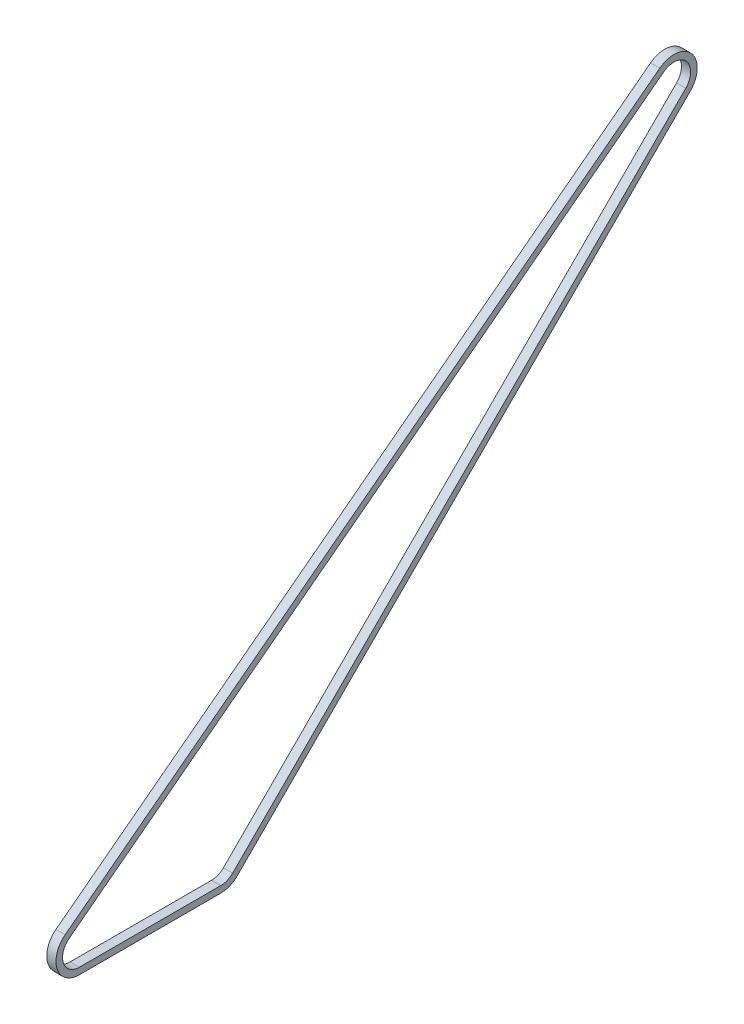
ISO-10303-21;
HEADER;
FILE_DESCRIPTION(('STEP AP214'),'2;1');
FILE_NAME('part.step','',(''),(''),'','','');
FILE_SCHEMA(('AUTOMOTIVE_DESIGN { 1 0 10303 214 1 1 1 1 }'));
ENDSEC;
DATA;
#1=APPLICATION_CONTEXT('core data for automotive mechanical design processes');
#2=APPLICATION_PROTOCOL_DEFINITION('international standard','automotive_design',2000,#1);
#3=PRODUCT_CONTEXT('',#1,'mechanical');
#4=PRODUCT('Part','Part','',(#3));
#5=PRODUCT_RELATED_PRODUCT_CATEGORY('part','',(#4));
#6=PRODUCT_DEFINITION_FORMATION('','',#4);
#7=PRODUCT_DEFINITION_CONTEXT('part definition',#1,'design');
#8=PRODUCT_DEFINITION('design','',#6,#7);
#9=PRODUCT_DEFINITION_SHAPE('','',#8);
#10=(LENGTH_UNIT() NAMED_UNIT(*) SI_UNIT(.MILLI.,.METRE.));
#11=(NAMED_UNIT(*) PLANE_ANGLE_UNIT() SI_UNIT($,.RADIAN.));
#12=(NAMED_UNIT(*) SI_UNIT($,.STERADIAN.) SOLID_ANGLE_UNIT());
#13=UNCERTAINTY_MEASURE_WITH_UNIT(LENGTH_MEASURE(1.E-05),#10,'distance_accuracy_value','');
#14=(GEOMETRIC_REPRESENTATION_CONTEXT(3) GLOBAL_UNCERTAINTY_ASSIGNED_CONTEXT((#13)) GLOBAL_UNIT_ASSIGNED_CONTEXT((#10,
#11,#12)) REPRESENTATION_CONTEXT('',''));
#15=CARTESIAN_POINT('',(0.,0.,0.));
#16=DIRECTION('',(0.,0.,1.));
#17=DIRECTION('',(1.,0.,0.));
#18=AXIS2_PLACEMENT_3D('',#15,#16,#17);
#19=CARTESIAN_POINT('',(8.407,16.9296795307969,12.9010532897323));
#20=DIRECTION('',(0.,0.795380762546252,0.606110091131423));
#21=DIRECTION('',(0.,-0.606110091131424,0.795380762546252));
#22=AXIS2_PLACEMENT_3D('',#19,#20,#21);
#23=PLANE('',#22);
#24=DIRECTION('',(0.,0.606110091131423,-0.795380762546252));
#25=VECTOR('',#24,1.);
#26=CARTESIAN_POINT('',(0.,16.9296795307969,12.9010532897323));
#27=LINE('',#26,#25);
#28=CARTESIAN_POINT('',(0.,16.9296795307969,12.9010532897323));
#29=VERTEX_POINT('',#28);
#30=CARTESIAN_POINT('',(0.,430.672723758447,-530.041990937922));
#31=VERTEX_POINT('',#30);
#32=EDGE_CURVE('E196',#29,#31,#27,.T.);
#33=ORIENTED_EDGE('',*,*,#32,.F.);
#34=DIRECTION('',(-1.,0.,0.));
#35=VECTOR('',#34,1.);
#36=CARTESIAN_POINT('',(8.407,16.9296795307969,12.9010532897323));
#37=LINE('',#36,#35);
#38=CARTESIAN_POINT('',(8.407,16.9296795307969,12.9010532897323));
#39=VERTEX_POINT('',#38);
#40=EDGE_CURVE('E11',#39,#29,#37,.T.);
#41=ORIENTED_EDGE('',*,*,#40,.F.);
#42=DIRECTION('',(0.,0.606110091131423,-0.795380762546252));
#43=VECTOR('',#42,1.);
#44=CARTESIAN_POINT('',(8.407,16.9296795307969,12.9010532897323));
#45=LINE('',#44,#43);
#46=CARTESIAN_POINT('',(8.407,430.672723758447,-530.041990937922));
#47=VERTEX_POINT('',#46);
#48=EDGE_CURVE('E219',#39,#47,#45,.T.);
#49=ORIENTED_EDGE('',*,*,#48,.T.);
#50=DIRECTION('',(-1.,0.,0.));
#51=VECTOR('',#50,1.);
#52=CARTESIAN_POINT('',(8.407,430.672723758447,-530.041990937922));
#53=LINE('',#52,#51);
#54=EDGE_CURVE('E106',#47,#31,#53,.T.);
#55=ORIENTED_EDGE('',*,*,#54,.T.);
#56=EDGE_LOOP('',(#33,#41,#49,#55));
#57=FACE_BOUND('',#56,.T.);
#58=ADVANCED_FACE('F41',(#57),#23,.T.);
#59=CARTESIAN_POINT('',(8.407,0.,0.));
#60=DIRECTION('',(-1.,0.,0.));
#61=DIRECTION('',(0.,0.,1.));
#62=AXIS2_PLACEMENT_3D('',#59,#60,#61);
#63=CYLINDRICAL_SURFACE('',#62,21.285);
#64=CARTESIAN_POINT('',(0.,0.,0.));
#65=DIRECTION('',(1.,0.,0.));
#66=DIRECTION('',(0.,0.,-1.));
#67=AXIS2_PLACEMENT_3D('',#64,#65,#66);
#68=CIRCLE('',#67,21.285);
#69=CARTESIAN_POINT('',(0.,-21.285,0.));
#70=VERTEX_POINT('',#69);
#71=EDGE_CURVE('E193',#29,#70,#68,.T.);
#72=ORIENTED_EDGE('',*,*,#71,.T.);
#73=DIRECTION('',(-1.,0.,0.));
#74=VECTOR('',#73,1.);
#75=CARTESIAN_POINT('',(8.407,-21.285,0.));
#76=LINE('',#75,#74);
#77=CARTESIAN_POINT('',(8.407,-21.285,0.));
#78=VERTEX_POINT('',#77);
#79=EDGE_CURVE('E51',#78,#70,#76,.T.);
#80=ORIENTED_EDGE('',*,*,#79,.F.);
#81=CARTESIAN_POINT('',(8.407,0.,0.));
#82=DIRECTION('',(1.,0.,0.));
#83=DIRECTION('',(0.,0.,-1.));
#84=AXIS2_PLACEMENT_3D('',#81,#82,#83);
#85=CIRCLE('',#84,21.285);
#86=EDGE_CURVE('E217',#39,#78,#85,.T.);
#87=ORIENTED_EDGE('',*,*,#86,.F.);
#88=ORIENTED_EDGE('',*,*,#40,.T.);
#89=EDGE_LOOP('',(#72,#80,#87,#88));
#90=FACE_BOUND('',#89,.T.);
#91=ADVANCED_FACE('F263',(#90),#63,.T.);
#92=CARTESIAN_POINT('',(8.407,-21.285,0.));
#93=DIRECTION('',(0.,1.,0.));
#94=DIRECTION('',(0.,0.,1.));
#95=AXIS2_PLACEMENT_3D('',#92,#93,#94);
#96=PLANE('',#95);
#97=DIRECTION('',(0.,0.,-1.));
#98=VECTOR('',#97,1.);
#99=CARTESIAN_POINT('',(0.,-21.285,0.));
#100=LINE('',#99,#98);
#101=CARTESIAN_POINT('',(0.,-21.285,-129.2));
#102=VERTEX_POINT('',#101);
#103=EDGE_CURVE('E190',#70,#102,#100,.T.);
#104=ORIENTED_EDGE('',*,*,#103,.T.);
#105=DIRECTION('',(-1.,0.,0.));
#106=VECTOR('',#105,1.);
#107=CARTESIAN_POINT('',(8.407,-21.285,-129.2));
#108=LINE('',#107,#106);
#109=CARTESIAN_POINT('',(8.407,-21.285,-129.2));
#110=VERTEX_POINT('',#109);
#111=EDGE_CURVE('E161',#110,#102,#108,.T.);
#112=ORIENTED_EDGE('',*,*,#111,.F.);
#113=DIRECTION('',(0.,0.,-1.));
#114=VECTOR('',#113,1.);
#115=CARTESIAN_POINT('',(8.407,-21.285,0.));
#116=LINE('',#115,#114);
#117=EDGE_CURVE('E154',#78,#110,#116,.T.);
#118=ORIENTED_EDGE('',*,*,#117,.F.);
#119=ORIENTED_EDGE('',*,*,#79,.T.);
#120=EDGE_LOOP('',(#104,#112,#118,#119));
#121=FACE_BOUND('',#120,.T.);
#122=ADVANCED_FACE('F268',(#121),#96,.F.);
#123=CARTESIAN_POINT('',(8.407,0.,-129.2));
#124=DIRECTION('',(-1.,0.,0.));
#125=DIRECTION('',(0.,0.,1.));
#126=AXIS2_PLACEMENT_3D('',#123,#124,#125);
#127=CYLINDRICAL_SURFACE('',#126,21.285);
#128=CARTESIAN_POINT('',(0.,0.,-129.2));
#129=DIRECTION('',(1.,0.,0.));
#130=DIRECTION('',(0.,0.,-1.));
#131=AXIS2_PLACEMENT_3D('',#128,#129,#130);
#132=CIRCLE('',#131,21.285);
#133=CARTESIAN_POINT('',(0.,-15.0507678375557,-144.250767837556));
#134=VERTEX_POINT('',#133);
#135=EDGE_CURVE('E160',#102,#134,#132,.T.);
#136=ORIENTED_EDGE('',*,*,#135,.T.);
#137=DIRECTION('',(-1.,0.,0.));
#138=VECTOR('',#137,1.);
#139=CARTESIAN_POINT('',(8.407,-15.0507678375557,-144.250767837556));
#140=LINE('',#139,#138);
#141=CARTESIAN_POINT('',(8.407,-15.0507678375557,-144.250767837556));
#142=VERTEX_POINT('',#141);
#143=EDGE_CURVE('E146',#142,#134,#140,.T.);
#144=ORIENTED_EDGE('',*,*,#143,.F.);
#145=CARTESIAN_POINT('',(8.407,0.,-129.2));
#146=DIRECTION('',(1.,0.,0.));
#147=DIRECTION('',(0.,0.,-1.));
#148=AXIS2_PLACEMENT_3D('',#145,#146,#147);
#149=CIRCLE('',#148,21.285);
#150=EDGE_CURVE('E149',#110,#142,#149,.T.);
#151=ORIENTED_EDGE('',*,*,#150,.F.);
#152=ORIENTED_EDGE('',*,*,#111,.T.);
#153=EDGE_LOOP('',(#136,#144,#151,#152));
#154=FACE_BOUND('',#153,.T.);
#155=ADVANCED_FACE('F159',(#154),#127,.T.);
#156=CARTESIAN_POINT('',(8.407,-79.6507678375557,-79.6507678375549));
#157=DIRECTION('',(0.,0.707106781186551,0.707106781186544));
#158=DIRECTION('',(0.,-0.707106781186544,0.707106781186551));
#159=AXIS2_PLACEMENT_3D('',#156,#157,#158);
#160=PLANE('',#159);
#161=DIRECTION('',(0.,0.707106781186544,-0.707106781186551));
#162=VECTOR('',#161,1.);
#163=CARTESIAN_POINT('',(0.,-79.6507678375557,-79.6507678375549));
#164=LINE('',#163,#162);
#165=CARTESIAN_POINT('',(0.,398.692276390094,-557.99381206521));
#166=VERTEX_POINT('',#165);
#167=EDGE_CURVE('E187',#134,#166,#164,.T.);
#168=ORIENTED_EDGE('',*,*,#167,.T.);
#169=DIRECTION('',(-1.,0.,0.));
#170=VECTOR('',#169,1.);
#171=CARTESIAN_POINT('',(8.407,398.692276390094,-557.99381206521));
#172=LINE('',#171,#170);
#173=CARTESIAN_POINT('',(8.407,398.692276390094,-557.99381206521));
#174=VERTEX_POINT('',#173);
#175=EDGE_CURVE('E148',#174,#166,#172,.T.);
#176=ORIENTED_EDGE('',*,*,#175,.F.);
#177=DIRECTION('',(0.,0.707106781186544,-0.707106781186551));
#178=VECTOR('',#177,1.);
#179=CARTESIAN_POINT('',(8.407,-79.6507678375557,-79.6507678375549));
#180=LINE('',#179,#178);
#181=EDGE_CURVE('E141',#142,#174,#180,.T.);
#182=ORIENTED_EDGE('',*,*,#181,.F.);
#183=ORIENTED_EDGE('',*,*,#143,.T.);
#184=EDGE_LOOP('',(#168,#176,#182,#183));
#185=FACE_BOUND('',#184,.T.);
#186=ADVANCED_FACE('F144',(#185),#160,.F.);
#187=CARTESIAN_POINT('',(8.407,0.,0.));
#188=DIRECTION('',(-1.,0.,0.));
#189=DIRECTION('',(0.,0.,1.));
#190=AXIS2_PLACEMENT_3D('',#187,#188,#189);
#191=CYLINDRICAL_SURFACE('',#190,15.291);
#192=CARTESIAN_POINT('',(0.,0.,0.));
#193=DIRECTION('',(1.,0.,0.));
#194=DIRECTION('',(0.,0.,-1.));
#195=AXIS2_PLACEMENT_3D('',#192,#193,#194);
#196=CIRCLE('',#195,15.291);
#197=CARTESIAN_POINT('',(0.,12.1621672400947,9.26802940349056));
#198=VERTEX_POINT('',#197);
#199=CARTESIAN_POINT('',(0.,-15.291,0.));
#200=VERTEX_POINT('',#199);
#201=EDGE_CURVE('E212',#198,#200,#196,.T.);
#202=ORIENTED_EDGE('',*,*,#201,.F.);
#203=DIRECTION('',(-1.,0.,0.));
#204=VECTOR('',#203,1.);
#205=CARTESIAN_POINT('',(8.407,12.1621672400947,9.26802940349056));
#206=LINE('',#205,#204);
#207=CARTESIAN_POINT('',(8.407,12.1621672400947,9.26802940349056));
#208=VERTEX_POINT('',#207);
#209=EDGE_CURVE('E45',#208,#198,#206,.T.);
#210=ORIENTED_EDGE('',*,*,#209,.F.);
#211=CARTESIAN_POINT('',(8.407,0.,0.));
#212=DIRECTION('',(1.,0.,0.));
#213=DIRECTION('',(0.,0.,-1.));
#214=AXIS2_PLACEMENT_3D('',#211,#212,#213);
#215=CIRCLE('',#214,15.291);
#216=CARTESIAN_POINT('',(8.407,-15.291,0.));
#217=VERTEX_POINT('',#216);
#218=EDGE_CURVE('E186',#208,#217,#215,.T.);
#219=ORIENTED_EDGE('',*,*,#218,.T.);
#220=DIRECTION('',(-1.,0.,0.));
#221=VECTOR('',#220,1.);
#222=CARTESIAN_POINT('',(8.407,-15.291,0.));
#223=LINE('',#222,#221);
#224=EDGE_CURVE('E169',#217,#200,#223,.T.);
#225=ORIENTED_EDGE('',*,*,#224,.T.);
#226=EDGE_LOOP('',(#202,#210,#219,#225));
#227=FACE_BOUND('',#226,.T.);
#228=ADVANCED_FACE('F43',(#227),#191,.F.);
#229=CARTESIAN_POINT('',(8.407,12.1621672400947,9.26802940349056));
#230=DIRECTION('',(0.,0.795380762546252,0.606110091131423));
#231=DIRECTION('',(0.,-0.606110091131423,0.795380762546252));
#232=AXIS2_PLACEMENT_3D('',#229,#230,#231);
#233=PLANE('',#232);
#234=DIRECTION('',(0.,0.606110091131424,-0.795380762546252));
#235=VECTOR('',#234,1.);
#236=CARTESIAN_POINT('',(0.,12.1621672400947,9.26802940349056));
#237=LINE('',#236,#235);
#238=CARTESIAN_POINT('',(0.,425.905211467744,-533.675014824163));
#239=VERTEX_POINT('',#238);
#240=EDGE_CURVE('E210',#198,#239,#237,.T.);
#241=ORIENTED_EDGE('',*,*,#240,.T.);
#242=DIRECTION('',(-1.,0.,0.));
#243=VECTOR('',#242,1.);
#244=CARTESIAN_POINT('',(8.407,425.905211467744,-533.675014824163));
#245=LINE('',#244,#243);
#246=CARTESIAN_POINT('',(8.407,425.905211467744,-533.675014824163));
#247=VERTEX_POINT('',#246);
#248=EDGE_CURVE('E176',#247,#239,#245,.T.);
#249=ORIENTED_EDGE('',*,*,#248,.F.);
#250=DIRECTION('',(0.,0.606110091131424,-0.795380762546252));
#251=VECTOR('',#250,1.);
#252=CARTESIAN_POINT('',(8.407,12.1621672400947,9.26802940349056));
#253=LINE('',#252,#251);
#254=EDGE_CURVE('E232',#208,#247,#253,.T.);
#255=ORIENTED_EDGE('',*,*,#254,.F.);
#256=ORIENTED_EDGE('',*,*,#209,.T.);
#257=EDGE_LOOP('',(#241,#249,#255,#256));
#258=FACE_BOUND('',#257,.T.);
#259=ADVANCED_FACE('F245',(#258),#233,.F.);
#260=CARTESIAN_POINT('',(8.407,413.74304422765,-542.943044227654));
#261=DIRECTION('',(-1.,0.,0.));
#262=DIRECTION('',(0.,0.,1.));
#263=AXIS2_PLACEMENT_3D('',#260,#261,#262);
#264=CYLINDRICAL_SURFACE('',#263,15.291);
#265=CARTESIAN_POINT('',(0.,413.74304422765,-542.943044227654));
#266=DIRECTION('',(1.,0.,0.));
#267=DIRECTION('',(0.,0.,-1.));
#268=AXIS2_PLACEMENT_3D('',#265,#266,#267);
#269=CIRCLE('',#268,15.291);
#270=CARTESIAN_POINT('',(0.,402.930674436526,-553.755414018777));
#271=VERTEX_POINT('',#270);
#272=EDGE_CURVE('E207',#271,#239,#269,.T.);
#273=ORIENTED_EDGE('',*,*,#272,.F.);
#274=DIRECTION('',(-1.,0.,0.));
#275=VECTOR('',#274,1.);
#276=CARTESIAN_POINT('',(8.407,402.930674436526,-553.755414018777));
#277=LINE('',#276,#275);
#278=CARTESIAN_POINT('',(8.407,402.930674436526,-553.755414018777));
#279=VERTEX_POINT('',#278);
#280=EDGE_CURVE('E175',#279,#271,#277,.T.);
#281=ORIENTED_EDGE('',*,*,#280,.F.);
#282=CARTESIAN_POINT('',(8.407,413.74304422765,-542.943044227654));
#283=DIRECTION('',(1.,0.,0.));
#284=DIRECTION('',(0.,0.,-1.));
#285=AXIS2_PLACEMENT_3D('',#282,#283,#284);
#286=CIRCLE('',#285,15.291);
#287=EDGE_CURVE('E230',#279,#247,#286,.T.);
#288=ORIENTED_EDGE('',*,*,#287,.T.);
#289=ORIENTED_EDGE('',*,*,#248,.T.);
#290=EDGE_LOOP('',(#273,#281,#288,#289));
#291=FACE_BOUND('',#290,.T.);
#292=ADVANCED_FACE('F247',(#291),#264,.F.);
#293=CARTESIAN_POINT('',(8.407,-75.4123697911235,-75.4123697911227));
#294=DIRECTION('',(0.,0.707106781186551,0.707106781186544));
#295=DIRECTION('',(0.,-0.707106781186544,0.707106781186551));
#296=AXIS2_PLACEMENT_3D('',#293,#294,#295);
#297=PLANE('',#296);
#298=DIRECTION('',(0.,0.707106781186544,-0.707106781186551));
#299=VECTOR('',#298,1.);
#300=CARTESIAN_POINT('',(0.,-75.4123697911235,-75.4123697911227));
#301=LINE('',#300,#299);
#302=CARTESIAN_POINT('',(0.,-10.8123697911235,-140.012369791123));
#303=VERTEX_POINT('',#302);
#304=EDGE_CURVE('E204',#303,#271,#301,.T.);
#305=ORIENTED_EDGE('',*,*,#304,.F.);
#306=DIRECTION('',(-1.,0.,0.));
#307=VECTOR('',#306,1.);
#308=CARTESIAN_POINT('',(8.407,-10.8123697911235,-140.012369791123));
#309=LINE('',#308,#307);
#310=CARTESIAN_POINT('',(8.407,-10.8123697911235,-140.012369791123));
#311=VERTEX_POINT('',#310);
#312=EDGE_CURVE('E173',#311,#303,#309,.T.);
#313=ORIENTED_EDGE('',*,*,#312,.F.);
#314=DIRECTION('',(0.,0.707106781186544,-0.707106781186551));
#315=VECTOR('',#314,1.);
#316=CARTESIAN_POINT('',(8.407,-75.4123697911235,-75.4123697911227));
#317=LINE('',#316,#315);
#318=EDGE_CURVE('E227',#311,#279,#317,.T.);
#319=ORIENTED_EDGE('',*,*,#318,.T.);
#320=ORIENTED_EDGE('',*,*,#280,.T.);
#321=EDGE_LOOP('',(#305,#313,#319,#320));
#322=FACE_BOUND('',#321,.T.);
#323=ADVANCED_FACE('F250',(#322),#297,.T.);
#324=CARTESIAN_POINT('',(8.407,0.,-129.2));
#325=DIRECTION('',(-1.,0.,0.));
#326=DIRECTION('',(0.,0.,1.));
#327=AXIS2_PLACEMENT_3D('',#324,#325,#326);
#328=CYLINDRICAL_SURFACE('',#327,15.291);
#329=CARTESIAN_POINT('',(0.,0.,-129.2));
#330=DIRECTION('',(1.,0.,0.));
#331=DIRECTION('',(0.,0.,-1.));
#332=AXIS2_PLACEMENT_3D('',#329,#330,#331);
#333=CIRCLE('',#332,15.291);
#334=CARTESIAN_POINT('',(0.,-15.291,-129.2));
#335=VERTEX_POINT('',#334);
#336=EDGE_CURVE('E201',#335,#303,#333,.T.);
#337=ORIENTED_EDGE('',*,*,#336,.F.);
#338=DIRECTION('',(-1.,0.,0.));
#339=VECTOR('',#338,1.);
#340=CARTESIAN_POINT('',(8.407,-15.291,-129.2));
#341=LINE('',#340,#339);
#342=CARTESIAN_POINT('',(8.407,-15.291,-129.2));
#343=VERTEX_POINT('',#342);
#344=EDGE_CURVE('E171',#343,#335,#341,.T.);
#345=ORIENTED_EDGE('',*,*,#344,.F.);
#346=CARTESIAN_POINT('',(8.407,0.,-129.2));
#347=DIRECTION('',(1.,0.,0.));
#348=DIRECTION('',(0.,0.,-1.));
#349=AXIS2_PLACEMENT_3D('',#346,#347,#348);
#350=CIRCLE('',#349,15.291);
#351=EDGE_CURVE('E224',#343,#311,#350,.T.);
#352=ORIENTED_EDGE('',*,*,#351,.T.);
#353=ORIENTED_EDGE('',*,*,#312,.T.);
#354=EDGE_LOOP('',(#337,#345,#352,#353));
#355=FACE_BOUND('',#354,.T.);
#356=ADVANCED_FACE('F252',(#355),#328,.F.);
#357=CARTESIAN_POINT('',(8.407,-15.291,0.));
#358=DIRECTION('',(0.,1.,0.));
#359=DIRECTION('',(0.,0.,1.));
#360=AXIS2_PLACEMENT_3D('',#357,#358,#359);
#361=PLANE('',#360);
#362=DIRECTION('',(0.,0.,-1.));
#363=VECTOR('',#362,1.);
#364=CARTESIAN_POINT('',(0.,-15.291,0.));
#365=LINE('',#364,#363);
#366=EDGE_CURVE('E198',#200,#335,#365,.T.);
#367=ORIENTED_EDGE('',*,*,#366,.F.);
#368=ORIENTED_EDGE('',*,*,#224,.F.);
#369=DIRECTION('',(0.,0.,-1.));
#370=VECTOR('',#369,1.);
#371=CARTESIAN_POINT('',(8.407,-15.291,0.));
#372=LINE('',#371,#370);
#373=EDGE_CURVE('E221',#217,#343,#372,.T.);
#374=ORIENTED_EDGE('',*,*,#373,.T.);
#375=ORIENTED_EDGE('',*,*,#344,.T.);
#376=EDGE_LOOP('',(#367,#368,#374,#375));
#377=FACE_BOUND('',#376,.T.);
#378=ADVANCED_FACE('F241',(#377),#361,.T.);
#379=CARTESIAN_POINT('',(8.407,413.74304422765,-542.943044227654));
#380=DIRECTION('',(-1.,0.,0.));
#381=DIRECTION('',(0.,0.,1.));
#382=AXIS2_PLACEMENT_3D('',#379,#380,#381);
#383=CYLINDRICAL_SURFACE('',#382,21.2849999999999);
#384=CARTESIAN_POINT('',(0.,413.74304422765,-542.943044227654));
#385=DIRECTION('',(1.,0.,0.));
#386=DIRECTION('',(0.,0.,-1.));
#387=AXIS2_PLACEMENT_3D('',#384,#385,#386);
#388=CIRCLE('',#387,21.2849999999999);
#389=EDGE_CURVE('E99',#166,#31,#388,.T.);
#390=ORIENTED_EDGE('',*,*,#389,.T.);
#391=ORIENTED_EDGE('',*,*,#54,.F.);
#392=CARTESIAN_POINT('',(8.407,413.74304422765,-542.943044227654));
#393=DIRECTION('',(1.,0.,0.));
#394=DIRECTION('',(0.,0.,-1.));
#395=AXIS2_PLACEMENT_3D('',#392,#393,#394);
#396=CIRCLE('',#395,21.2849999999999);
#397=EDGE_CURVE('E60',#174,#47,#396,.T.);
#398=ORIENTED_EDGE('',*,*,#397,.F.);
#399=ORIENTED_EDGE('',*,*,#175,.T.);
#400=EDGE_LOOP('',(#390,#391,#398,#399));
#401=FACE_BOUND('',#400,.T.);
#402=ADVANCED_FACE('F259',(#401),#383,.T.);
#403=CARTESIAN_POINT('',(8.407,0.,0.));
#404=DIRECTION('',(1.,0.,0.));
#405=DIRECTION('',(0.,0.,-1.));
#406=AXIS2_PLACEMENT_3D('',#403,#404,#405);
#407=PLANE('',#406);
#408=ORIENTED_EDGE('',*,*,#218,.F.);
#409=ORIENTED_EDGE('',*,*,#254,.T.);
#410=ORIENTED_EDGE('',*,*,#287,.F.);
#411=ORIENTED_EDGE('',*,*,#318,.F.);
#412=ORIENTED_EDGE('',*,*,#351,.F.);
#413=ORIENTED_EDGE('',*,*,#373,.F.);
#414=EDGE_LOOP('',(#408,#409,#410,#411,#412,#413));
#415=FACE_BOUND('',#414,.T.);
#416=ORIENTED_EDGE('',*,*,#48,.F.);
#417=ORIENTED_EDGE('',*,*,#86,.T.);
#418=ORIENTED_EDGE('',*,*,#117,.T.);
#419=ORIENTED_EDGE('',*,*,#150,.T.);
#420=ORIENTED_EDGE('',*,*,#181,.T.);
#421=ORIENTED_EDGE('',*,*,#397,.T.);
#422=EDGE_LOOP('',(#416,#417,#418,#419,#420,#421));
#423=FACE_BOUND('',#422,.T.);
#424=ADVANCED_FACE('F152',(#415,#423),#407,.T.);
#425=CARTESIAN_POINT('',(0.,0.,0.));
#426=DIRECTION('',(1.,0.,0.));
#427=DIRECTION('',(0.,0.,-1.));
#428=AXIS2_PLACEMENT_3D('',#425,#426,#427);
#429=PLANE('',#428);
#430=ORIENTED_EDGE('',*,*,#201,.T.);
#431=ORIENTED_EDGE('',*,*,#366,.T.);
#432=ORIENTED_EDGE('',*,*,#336,.T.);
#433=ORIENTED_EDGE('',*,*,#304,.T.);
#434=ORIENTED_EDGE('',*,*,#272,.T.);
#435=ORIENTED_EDGE('',*,*,#240,.F.);
#436=EDGE_LOOP('',(#430,#431,#432,#433,#434,#435));
#437=FACE_BOUND('',#436,.T.);
#438=ORIENTED_EDGE('',*,*,#32,.T.);
#439=ORIENTED_EDGE('',*,*,#389,.F.);
#440=ORIENTED_EDGE('',*,*,#167,.F.);
#441=ORIENTED_EDGE('',*,*,#135,.F.);
#442=ORIENTED_EDGE('',*,*,#103,.F.);
#443=ORIENTED_EDGE('',*,*,#71,.F.);
#444=EDGE_LOOP('',(#438,#439,#440,#441,#442,#443));
#445=FACE_BOUND('',#444,.T.);
#446=ADVANCED_FACE('F244',(#437,#445),#429,.F.);
#447=CLOSED_SHELL('',(#58,#91,#122,#155,#186,#228,#259,#292,#323,#356,#378,#402,#424,#446));
#448=MANIFOLD_SOLID_BREP('B2',#447);
#449=ADVANCED_BREP_SHAPE_REPRESENTATION('',(#18,#448),#14);
#450=SHAPE_DEFINITION_REPRESENTATION(#9,#449);
ENDSEC;
END-ISO-10303-21;
